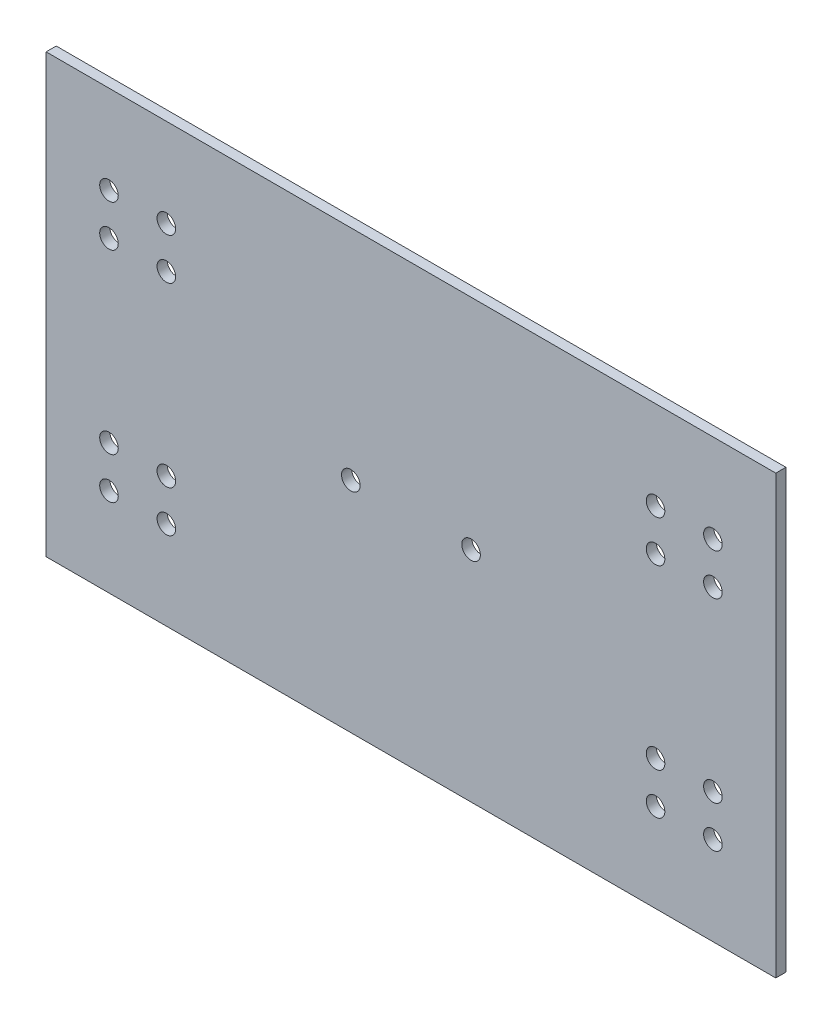
ISO-10303-21;
HEADER;
FILE_DESCRIPTION(('STEP AP214'),'2;1');
FILE_NAME('part.step','',(''),(''),'','','');
FILE_SCHEMA(('AUTOMOTIVE_DESIGN { 1 0 10303 214 1 1 1 1 }'));
ENDSEC;
DATA;
#1=APPLICATION_CONTEXT('core data for automotive mechanical design processes');
#2=APPLICATION_PROTOCOL_DEFINITION('international standard','automotive_design',2000,#1);
#3=PRODUCT_CONTEXT('',#1,'mechanical');
#4=PRODUCT('Part','Part','',(#3));
#5=PRODUCT_RELATED_PRODUCT_CATEGORY('part','',(#4));
#6=PRODUCT_DEFINITION_FORMATION('','',#4);
#7=PRODUCT_DEFINITION_CONTEXT('part definition',#1,'design');
#8=PRODUCT_DEFINITION('design','',#6,#7);
#9=PRODUCT_DEFINITION_SHAPE('','',#8);
#10=(LENGTH_UNIT() NAMED_UNIT(*) SI_UNIT(.MILLI.,.METRE.));
#11=(NAMED_UNIT(*) PLANE_ANGLE_UNIT() SI_UNIT($,.RADIAN.));
#12=(NAMED_UNIT(*) SI_UNIT($,.STERADIAN.) SOLID_ANGLE_UNIT());
#13=UNCERTAINTY_MEASURE_WITH_UNIT(LENGTH_MEASURE(1.E-05),#10,'distance_accuracy_value','');
#14=(GEOMETRIC_REPRESENTATION_CONTEXT(3) GLOBAL_UNCERTAINTY_ASSIGNED_CONTEXT((#13)) GLOBAL_UNIT_ASSIGNED_CONTEXT((#10,
#11,#12)) REPRESENTATION_CONTEXT('',''));
#15=CARTESIAN_POINT('',(0.,0.,0.));
#16=DIRECTION('',(0.,0.,1.));
#17=DIRECTION('',(1.,0.,0.));
#18=AXIS2_PLACEMENT_3D('',#15,#16,#17);
#19=CARTESIAN_POINT('',(155.5,80.0000000000001,3.7));
#20=DIRECTION('',(0.,0.,-1.));
#21=DIRECTION('',(-1.,0.,0.));
#22=AXIS2_PLACEMENT_3D('',#19,#20,#21);
#23=CYLINDRICAL_SURFACE('',#22,3.4);
#24=CARTESIAN_POINT('',(155.5,80.0000000000001,3.7));
#25=DIRECTION('',(0.,0.,1.));
#26=DIRECTION('',(1.,0.,0.));
#27=AXIS2_PLACEMENT_3D('',#24,#25,#26);
#28=CIRCLE('',#27,3.4);
#29=CARTESIAN_POINT('',(158.9,80.0000000000001,3.7));
#30=VERTEX_POINT('',#29);
#31=EDGE_CURVE('E205',#30,#30,#28,.F.);
#32=ORIENTED_EDGE('',*,*,#31,.F.);
#33=EDGE_LOOP('',(#32));
#34=FACE_BOUND('',#33,.T.);
#35=CARTESIAN_POINT('',(155.5,80.0000000000001,0.));
#36=DIRECTION('',(0.,0.,1.));
#37=DIRECTION('',(1.,0.,0.));
#38=AXIS2_PLACEMENT_3D('',#35,#36,#37);
#39=CIRCLE('',#38,3.4);
#40=CARTESIAN_POINT('',(158.9,80.0000000000001,0.));
#41=VERTEX_POINT('',#40);
#42=EDGE_CURVE('E303',#41,#41,#39,.F.);
#43=ORIENTED_EDGE('',*,*,#42,.T.);
#44=EDGE_LOOP('',(#43));
#45=FACE_BOUND('',#44,.T.);
#46=ADVANCED_FACE('F128',(#34,#45),#23,.F.);
#47=CARTESIAN_POINT('',(44.,127.6,3.7));
#48=DIRECTION('',(0.,0.,-1.));
#49=DIRECTION('',(-1.,0.,0.));
#50=AXIS2_PLACEMENT_3D('',#47,#48,#49);
#51=CYLINDRICAL_SURFACE('',#50,3.4);
#52=CARTESIAN_POINT('',(44.,127.6,3.7));
#53=DIRECTION('',(0.,0.,1.));
#54=DIRECTION('',(1.,0.,0.));
#55=AXIS2_PLACEMENT_3D('',#52,#53,#54);
#56=CIRCLE('',#55,3.4);
#57=CARTESIAN_POINT('',(47.4,127.6,3.7));
#58=VERTEX_POINT('',#57);
#59=EDGE_CURVE('E202',#58,#58,#56,.F.);
#60=ORIENTED_EDGE('',*,*,#59,.F.);
#61=EDGE_LOOP('',(#60));
#62=FACE_BOUND('',#61,.T.);
#63=CARTESIAN_POINT('',(44.,127.6,0.));
#64=DIRECTION('',(0.,0.,1.));
#65=DIRECTION('',(1.,0.,0.));
#66=AXIS2_PLACEMENT_3D('',#63,#64,#65);
#67=CIRCLE('',#66,3.4);
#68=CARTESIAN_POINT('',(47.4,127.6,0.));
#69=VERTEX_POINT('',#68);
#70=EDGE_CURVE('E299',#69,#69,#67,.F.);
#71=ORIENTED_EDGE('',*,*,#70,.T.);
#72=EDGE_LOOP('',(#71));
#73=FACE_BOUND('',#72,.T.);
#74=ADVANCED_FACE('F366',(#62,#73),#51,.F.);
#75=CARTESIAN_POINT('',(23.,112.4,3.7));
#76=DIRECTION('',(0.,0.,-1.));
#77=DIRECTION('',(-1.,0.,0.));
#78=AXIS2_PLACEMENT_3D('',#75,#76,#77);
#79=CYLINDRICAL_SURFACE('',#78,3.4);
#80=CARTESIAN_POINT('',(23.,112.4,3.7));
#81=DIRECTION('',(0.,0.,1.));
#82=DIRECTION('',(1.,0.,0.));
#83=AXIS2_PLACEMENT_3D('',#80,#81,#82);
#84=CIRCLE('',#83,3.4);
#85=CARTESIAN_POINT('',(26.4,112.4,3.7));
#86=VERTEX_POINT('',#85);
#87=EDGE_CURVE('E199',#86,#86,#84,.F.);
#88=ORIENTED_EDGE('',*,*,#87,.F.);
#89=EDGE_LOOP('',(#88));
#90=FACE_BOUND('',#89,.T.);
#91=CARTESIAN_POINT('',(23.,112.4,0.));
#92=DIRECTION('',(0.,0.,1.));
#93=DIRECTION('',(1.,0.,0.));
#94=AXIS2_PLACEMENT_3D('',#91,#92,#93);
#95=CIRCLE('',#94,3.4);
#96=CARTESIAN_POINT('',(26.4,112.4,0.));
#97=VERTEX_POINT('',#96);
#98=EDGE_CURVE('E295',#97,#97,#95,.F.);
#99=ORIENTED_EDGE('',*,*,#98,.T.);
#100=EDGE_LOOP('',(#99));
#101=FACE_BOUND('',#100,.T.);
#102=ADVANCED_FACE('F372',(#90,#101),#79,.F.);
#103=CARTESIAN_POINT('',(244.,32.4,3.7));
#104=DIRECTION('',(0.,0.,-1.));
#105=DIRECTION('',(-1.,0.,0.));
#106=AXIS2_PLACEMENT_3D('',#103,#104,#105);
#107=CYLINDRICAL_SURFACE('',#106,3.4);
#108=CARTESIAN_POINT('',(244.,32.4,3.7));
#109=DIRECTION('',(0.,0.,1.));
#110=DIRECTION('',(1.,0.,0.));
#111=AXIS2_PLACEMENT_3D('',#108,#109,#110);
#112=CIRCLE('',#111,3.4);
#113=CARTESIAN_POINT('',(247.4,32.4,3.7));
#114=VERTEX_POINT('',#113);
#115=EDGE_CURVE('E196',#114,#114,#112,.F.);
#116=ORIENTED_EDGE('',*,*,#115,.F.);
#117=EDGE_LOOP('',(#116));
#118=FACE_BOUND('',#117,.T.);
#119=CARTESIAN_POINT('',(244.,32.4,0.));
#120=DIRECTION('',(0.,0.,1.));
#121=DIRECTION('',(1.,0.,0.));
#122=AXIS2_PLACEMENT_3D('',#119,#120,#121);
#123=CIRCLE('',#122,3.4);
#124=CARTESIAN_POINT('',(247.4,32.4,0.));
#125=VERTEX_POINT('',#124);
#126=EDGE_CURVE('E291',#125,#125,#123,.F.);
#127=ORIENTED_EDGE('',*,*,#126,.T.);
#128=EDGE_LOOP('',(#127));
#129=FACE_BOUND('',#128,.T.);
#130=ADVANCED_FACE('F379',(#118,#129),#107,.F.);
#131=CARTESIAN_POINT('',(223.,47.6,3.7));
#132=DIRECTION('',(0.,0.,-1.));
#133=DIRECTION('',(-1.,0.,0.));
#134=AXIS2_PLACEMENT_3D('',#131,#132,#133);
#135=CYLINDRICAL_SURFACE('',#134,3.4);
#136=CARTESIAN_POINT('',(223.,47.6,3.7));
#137=DIRECTION('',(0.,0.,1.));
#138=DIRECTION('',(1.,0.,0.));
#139=AXIS2_PLACEMENT_3D('',#136,#137,#138);
#140=CIRCLE('',#139,3.4);
#141=CARTESIAN_POINT('',(226.4,47.6,3.7));
#142=VERTEX_POINT('',#141);
#143=EDGE_CURVE('E190',#142,#142,#140,.F.);
#144=ORIENTED_EDGE('',*,*,#143,.F.);
#145=EDGE_LOOP('',(#144));
#146=FACE_BOUND('',#145,.T.);
#147=CARTESIAN_POINT('',(223.,47.6,0.));
#148=DIRECTION('',(0.,0.,1.));
#149=DIRECTION('',(1.,0.,0.));
#150=AXIS2_PLACEMENT_3D('',#147,#148,#149);
#151=CIRCLE('',#150,3.4);
#152=CARTESIAN_POINT('',(226.4,47.6,0.));
#153=VERTEX_POINT('',#152);
#154=EDGE_CURVE('E285',#153,#153,#151,.F.);
#155=ORIENTED_EDGE('',*,*,#154,.T.);
#156=EDGE_LOOP('',(#155));
#157=FACE_BOUND('',#156,.T.);
#158=ADVANCED_FACE('F383',(#146,#157),#135,.F.);
#159=CARTESIAN_POINT('',(0.,0.,3.7));
#160=DIRECTION('',(1.,0.,0.));
#161=DIRECTION('',(0.,1.,0.));
#162=AXIS2_PLACEMENT_3D('',#159,#160,#161);
#163=PLANE('',#162);
#164=DIRECTION('',(0.,-1.,0.));
#165=VECTOR('',#164,1.);
#166=CARTESIAN_POINT('',(0.,0.,0.));
#167=LINE('',#166,#165);
#168=CARTESIAN_POINT('',(0.,160.,0.));
#169=VERTEX_POINT('',#168);
#170=CARTESIAN_POINT('',(0.,0.,0.));
#171=VERTEX_POINT('',#170);
#172=EDGE_CURVE('E184',#169,#171,#167,.T.);
#173=ORIENTED_EDGE('',*,*,#172,.T.);
#174=DIRECTION('',(0.,0.,-1.));
#175=VECTOR('',#174,1.);
#176=CARTESIAN_POINT('',(0.,0.,3.7));
#177=LINE('',#176,#175);
#178=CARTESIAN_POINT('',(0.,0.,3.7));
#179=VERTEX_POINT('',#178);
#180=EDGE_CURVE('E137',#179,#171,#177,.T.);
#181=ORIENTED_EDGE('',*,*,#180,.F.);
#182=DIRECTION('',(0.,-1.,0.));
#183=VECTOR('',#182,1.);
#184=CARTESIAN_POINT('',(0.,0.,3.7));
#185=LINE('',#184,#183);
#186=CARTESIAN_POINT('',(0.,160.,3.7));
#187=VERTEX_POINT('',#186);
#188=EDGE_CURVE('E170',#187,#179,#185,.T.);
#189=ORIENTED_EDGE('',*,*,#188,.F.);
#190=DIRECTION('',(0.,0.,-1.));
#191=VECTOR('',#190,1.);
#192=CARTESIAN_POINT('',(0.,160.,3.7));
#193=LINE('',#192,#191);
#194=EDGE_CURVE('E13',#187,#169,#193,.T.);
#195=ORIENTED_EDGE('',*,*,#194,.T.);
#196=EDGE_LOOP('',(#173,#181,#189,#195));
#197=FACE_BOUND('',#196,.T.);
#198=ADVANCED_FACE('F183',(#197),#163,.F.);
#199=CARTESIAN_POINT('',(0.,0.,3.7));
#200=DIRECTION('',(0.,-1.,0.));
#201=DIRECTION('',(1.,0.,0.));
#202=AXIS2_PLACEMENT_3D('',#199,#200,#201);
#203=PLANE('',#202);
#204=DIRECTION('',(-1.,0.,0.));
#205=VECTOR('',#204,1.);
#206=CARTESIAN_POINT('',(0.,0.,0.));
#207=LINE('',#206,#205);
#208=CARTESIAN_POINT('',(267.,0.,0.));
#209=VERTEX_POINT('',#208);
#210=EDGE_CURVE('E286',#209,#171,#207,.T.);
#211=ORIENTED_EDGE('',*,*,#210,.F.);
#212=DIRECTION('',(0.,0.,-1.));
#213=VECTOR('',#212,1.);
#214=CARTESIAN_POINT('',(267.,0.,3.7));
#215=LINE('',#214,#213);
#216=CARTESIAN_POINT('',(267.,0.,3.7));
#217=VERTEX_POINT('',#216);
#218=EDGE_CURVE('E159',#217,#209,#215,.T.);
#219=ORIENTED_EDGE('',*,*,#218,.F.);
#220=DIRECTION('',(-1.,0.,0.));
#221=VECTOR('',#220,1.);
#222=CARTESIAN_POINT('',(0.,0.,3.7));
#223=LINE('',#222,#221);
#224=EDGE_CURVE('E178',#217,#179,#223,.T.);
#225=ORIENTED_EDGE('',*,*,#224,.T.);
#226=ORIENTED_EDGE('',*,*,#180,.T.);
#227=EDGE_LOOP('',(#211,#219,#225,#226));
#228=FACE_BOUND('',#227,.T.);
#229=ADVANCED_FACE('F187',(#228),#203,.T.);
#230=CARTESIAN_POINT('',(267.,0.,3.7));
#231=DIRECTION('',(1.,0.,0.));
#232=DIRECTION('',(0.,0.,-1.));
#233=AXIS2_PLACEMENT_3D('',#230,#231,#232);
#234=PLANE('',#233);
#235=DIRECTION('',(0.,-1.,0.));
#236=VECTOR('',#235,1.);
#237=CARTESIAN_POINT('',(267.,0.,0.));
#238=LINE('',#237,#236);
#239=CARTESIAN_POINT('',(267.,160.,0.));
#240=VERTEX_POINT('',#239);
#241=EDGE_CURVE('E280',#240,#209,#238,.T.);
#242=ORIENTED_EDGE('',*,*,#241,.F.);
#243=DIRECTION('',(0.,0.,-1.));
#244=VECTOR('',#243,1.);
#245=CARTESIAN_POINT('',(267.,160.,3.7));
#246=LINE('',#245,#244);
#247=CARTESIAN_POINT('',(267.,160.,3.7));
#248=VERTEX_POINT('',#247);
#249=EDGE_CURVE('E145',#248,#240,#246,.T.);
#250=ORIENTED_EDGE('',*,*,#249,.F.);
#251=DIRECTION('',(0.,-1.,0.));
#252=VECTOR('',#251,1.);
#253=CARTESIAN_POINT('',(267.,0.,3.7));
#254=LINE('',#253,#252);
#255=EDGE_CURVE('E188',#248,#217,#254,.T.);
#256=ORIENTED_EDGE('',*,*,#255,.T.);
#257=ORIENTED_EDGE('',*,*,#218,.T.);
#258=EDGE_LOOP('',(#242,#250,#256,#257));
#259=FACE_BOUND('',#258,.T.);
#260=ADVANCED_FACE('F388',(#259),#234,.T.);
#261=CARTESIAN_POINT('',(0.,160.,3.7));
#262=DIRECTION('',(0.,-1.,0.));
#263=DIRECTION('',(1.,0.,0.));
#264=AXIS2_PLACEMENT_3D('',#261,#262,#263);
#265=PLANE('',#264);
#266=DIRECTION('',(-1.,0.,0.));
#267=VECTOR('',#266,1.);
#268=CARTESIAN_POINT('',(0.,160.,0.));
#269=LINE('',#268,#267);
#270=EDGE_CURVE('E273',#240,#169,#269,.T.);
#271=ORIENTED_EDGE('',*,*,#270,.T.);
#272=ORIENTED_EDGE('',*,*,#194,.F.);
#273=DIRECTION('',(-1.,0.,0.));
#274=VECTOR('',#273,1.);
#275=CARTESIAN_POINT('',(0.,160.,3.7));
#276=LINE('',#275,#274);
#277=EDGE_CURVE('E179',#248,#187,#276,.T.);
#278=ORIENTED_EDGE('',*,*,#277,.F.);
#279=ORIENTED_EDGE('',*,*,#249,.T.);
#280=EDGE_LOOP('',(#271,#272,#278,#279));
#281=FACE_BOUND('',#280,.T.);
#282=ADVANCED_FACE('F391',(#281),#265,.F.);
#283=CARTESIAN_POINT('',(23.,47.6,3.7));
#284=DIRECTION('',(0.,0.,-1.));
#285=DIRECTION('',(-1.,0.,0.));
#286=AXIS2_PLACEMENT_3D('',#283,#284,#285);
#287=CYLINDRICAL_SURFACE('',#286,3.4);
#288=CARTESIAN_POINT('',(23.,47.6,3.7));
#289=DIRECTION('',(0.,0.,1.));
#290=DIRECTION('',(1.,0.,0.));
#291=AXIS2_PLACEMENT_3D('',#288,#289,#290);
#292=CIRCLE('',#291,3.4);
#293=CARTESIAN_POINT('',(26.4,47.6,3.7));
#294=VERTEX_POINT('',#293);
#295=EDGE_CURVE('E349',#294,#294,#292,.T.);
#296=ORIENTED_EDGE('',*,*,#295,.T.);
#297=EDGE_LOOP('',(#296));
#298=FACE_BOUND('',#297,.T.);
#299=CARTESIAN_POINT('',(23.,47.6,0.));
#300=DIRECTION('',(0.,0.,1.));
#301=DIRECTION('',(1.,0.,0.));
#302=AXIS2_PLACEMENT_3D('',#299,#300,#301);
#303=CIRCLE('',#302,3.4);
#304=CARTESIAN_POINT('',(26.4,47.6,0.));
#305=VERTEX_POINT('',#304);
#306=EDGE_CURVE('E268',#305,#305,#303,.T.);
#307=ORIENTED_EDGE('',*,*,#306,.F.);
#308=EDGE_LOOP('',(#307));
#309=FACE_BOUND('',#308,.T.);
#310=ADVANCED_FACE('F353',(#298,#309),#287,.F.);
#311=CARTESIAN_POINT('',(44.,47.6,3.7));
#312=DIRECTION('',(0.,0.,-1.));
#313=DIRECTION('',(-1.,0.,0.));
#314=AXIS2_PLACEMENT_3D('',#311,#312,#313);
#315=CYLINDRICAL_SURFACE('',#314,3.4);
#316=CARTESIAN_POINT('',(44.,47.6,3.7));
#317=DIRECTION('',(0.,0.,1.));
#318=DIRECTION('',(1.,0.,0.));
#319=AXIS2_PLACEMENT_3D('',#316,#317,#318);
#320=CIRCLE('',#319,3.4);
#321=CARTESIAN_POINT('',(47.4,47.6,3.7));
#322=VERTEX_POINT('',#321);
#323=EDGE_CURVE('E346',#322,#322,#320,.T.);
#324=ORIENTED_EDGE('',*,*,#323,.T.);
#325=EDGE_LOOP('',(#324));
#326=FACE_BOUND('',#325,.T.);
#327=CARTESIAN_POINT('',(44.,47.6,0.));
#328=DIRECTION('',(0.,0.,1.));
#329=DIRECTION('',(1.,0.,0.));
#330=AXIS2_PLACEMENT_3D('',#327,#328,#329);
#331=CIRCLE('',#330,3.4);
#332=CARTESIAN_POINT('',(47.4,47.6,0.));
#333=VERTEX_POINT('',#332);
#334=EDGE_CURVE('E264',#333,#333,#331,.T.);
#335=ORIENTED_EDGE('',*,*,#334,.F.);
#336=EDGE_LOOP('',(#335));
#337=FACE_BOUND('',#336,.T.);
#338=ADVANCED_FACE('F400',(#326,#337),#315,.F.);
#339=CARTESIAN_POINT('',(23.,32.4,3.7));
#340=DIRECTION('',(0.,0.,-1.));
#341=DIRECTION('',(-1.,0.,0.));
#342=AXIS2_PLACEMENT_3D('',#339,#340,#341);
#343=CYLINDRICAL_SURFACE('',#342,3.4);
#344=CARTESIAN_POINT('',(23.,32.4,3.7));
#345=DIRECTION('',(0.,0.,1.));
#346=DIRECTION('',(1.,0.,0.));
#347=AXIS2_PLACEMENT_3D('',#344,#345,#346);
#348=CIRCLE('',#347,3.4);
#349=CARTESIAN_POINT('',(26.4,32.4,3.7));
#350=VERTEX_POINT('',#349);
#351=EDGE_CURVE('E343',#350,#350,#348,.T.);
#352=ORIENTED_EDGE('',*,*,#351,.T.);
#353=EDGE_LOOP('',(#352));
#354=FACE_BOUND('',#353,.T.);
#355=CARTESIAN_POINT('',(23.,32.4,0.));
#356=DIRECTION('',(0.,0.,1.));
#357=DIRECTION('',(1.,0.,0.));
#358=AXIS2_PLACEMENT_3D('',#355,#356,#357);
#359=CIRCLE('',#358,3.4);
#360=CARTESIAN_POINT('',(26.4,32.4,0.));
#361=VERTEX_POINT('',#360);
#362=EDGE_CURVE('E256',#361,#361,#359,.T.);
#363=ORIENTED_EDGE('',*,*,#362,.F.);
#364=EDGE_LOOP('',(#363));
#365=FACE_BOUND('',#364,.T.);
#366=ADVANCED_FACE('F403',(#354,#365),#343,.F.);
#367=CARTESIAN_POINT('',(44.,32.4,3.7));
#368=DIRECTION('',(0.,0.,-1.));
#369=DIRECTION('',(-1.,0.,0.));
#370=AXIS2_PLACEMENT_3D('',#367,#368,#369);
#371=CYLINDRICAL_SURFACE('',#370,3.4);
#372=CARTESIAN_POINT('',(44.,32.4,3.7));
#373=DIRECTION('',(0.,0.,1.));
#374=DIRECTION('',(1.,0.,0.));
#375=AXIS2_PLACEMENT_3D('',#372,#373,#374);
#376=CIRCLE('',#375,3.4);
#377=CARTESIAN_POINT('',(47.4,32.4,3.7));
#378=VERTEX_POINT('',#377);
#379=EDGE_CURVE('E340',#378,#378,#376,.T.);
#380=ORIENTED_EDGE('',*,*,#379,.T.);
#381=EDGE_LOOP('',(#380));
#382=FACE_BOUND('',#381,.T.);
#383=CARTESIAN_POINT('',(44.,32.4,0.));
#384=DIRECTION('',(0.,0.,1.));
#385=DIRECTION('',(1.,0.,0.));
#386=AXIS2_PLACEMENT_3D('',#383,#384,#385);
#387=CIRCLE('',#386,3.4);
#388=CARTESIAN_POINT('',(47.4,32.4,0.));
#389=VERTEX_POINT('',#388);
#390=EDGE_CURVE('E251',#389,#389,#387,.T.);
#391=ORIENTED_EDGE('',*,*,#390,.F.);
#392=EDGE_LOOP('',(#391));
#393=FACE_BOUND('',#392,.T.);
#394=ADVANCED_FACE('F407',(#382,#393),#371,.F.);
#395=CARTESIAN_POINT('',(223.,32.4,3.7));
#396=DIRECTION('',(0.,0.,-1.));
#397=DIRECTION('',(-1.,0.,0.));
#398=AXIS2_PLACEMENT_3D('',#395,#396,#397);
#399=CYLINDRICAL_SURFACE('',#398,3.4);
#400=CARTESIAN_POINT('',(223.,32.4,3.7));
#401=DIRECTION('',(0.,0.,1.));
#402=DIRECTION('',(1.,0.,0.));
#403=AXIS2_PLACEMENT_3D('',#400,#401,#402);
#404=CIRCLE('',#403,3.4);
#405=CARTESIAN_POINT('',(226.4,32.4,3.7));
#406=VERTEX_POINT('',#405);
#407=EDGE_CURVE('E337',#406,#406,#404,.F.);
#408=ORIENTED_EDGE('',*,*,#407,.F.);
#409=EDGE_LOOP('',(#408));
#410=FACE_BOUND('',#409,.T.);
#411=CARTESIAN_POINT('',(223.,32.4,0.));
#412=DIRECTION('',(0.,0.,1.));
#413=DIRECTION('',(1.,0.,0.));
#414=AXIS2_PLACEMENT_3D('',#411,#412,#413);
#415=CIRCLE('',#414,3.4);
#416=CARTESIAN_POINT('',(226.4,32.4,0.));
#417=VERTEX_POINT('',#416);
#418=EDGE_CURVE('E247',#417,#417,#415,.F.);
#419=ORIENTED_EDGE('',*,*,#418,.T.);
#420=EDGE_LOOP('',(#419));
#421=FACE_BOUND('',#420,.T.);
#422=ADVANCED_FACE('F411',(#410,#421),#399,.F.);
#423=CARTESIAN_POINT('',(244.,47.6,3.7));
#424=DIRECTION('',(0.,0.,-1.));
#425=DIRECTION('',(-1.,0.,0.));
#426=AXIS2_PLACEMENT_3D('',#423,#424,#425);
#427=CYLINDRICAL_SURFACE('',#426,3.4);
#428=CARTESIAN_POINT('',(244.,47.6,3.7));
#429=DIRECTION('',(0.,0.,1.));
#430=DIRECTION('',(1.,0.,0.));
#431=AXIS2_PLACEMENT_3D('',#428,#429,#430);
#432=CIRCLE('',#431,3.4);
#433=CARTESIAN_POINT('',(247.4,47.6,3.7));
#434=VERTEX_POINT('',#433);
#435=EDGE_CURVE('E334',#434,#434,#432,.F.);
#436=ORIENTED_EDGE('',*,*,#435,.F.);
#437=EDGE_LOOP('',(#436));
#438=FACE_BOUND('',#437,.T.);
#439=CARTESIAN_POINT('',(244.,47.6,0.));
#440=DIRECTION('',(0.,0.,1.));
#441=DIRECTION('',(1.,0.,0.));
#442=AXIS2_PLACEMENT_3D('',#439,#440,#441);
#443=CIRCLE('',#442,3.4);
#444=CARTESIAN_POINT('',(247.4,47.6,0.));
#445=VERTEX_POINT('',#444);
#446=EDGE_CURVE('E243',#445,#445,#443,.F.);
#447=ORIENTED_EDGE('',*,*,#446,.T.);
#448=EDGE_LOOP('',(#447));
#449=FACE_BOUND('',#448,.T.);
#450=ADVANCED_FACE('F415',(#438,#449),#427,.F.);
#451=CARTESIAN_POINT('',(23.,127.6,3.7));
#452=DIRECTION('',(0.,0.,-1.));
#453=DIRECTION('',(-1.,0.,0.));
#454=AXIS2_PLACEMENT_3D('',#451,#452,#453);
#455=CYLINDRICAL_SURFACE('',#454,3.4);
#456=CARTESIAN_POINT('',(23.,127.6,3.7));
#457=DIRECTION('',(0.,0.,1.));
#458=DIRECTION('',(1.,0.,0.));
#459=AXIS2_PLACEMENT_3D('',#456,#457,#458);
#460=CIRCLE('',#459,3.4);
#461=CARTESIAN_POINT('',(26.4,127.6,3.7));
#462=VERTEX_POINT('',#461);
#463=EDGE_CURVE('E331',#462,#462,#460,.F.);
#464=ORIENTED_EDGE('',*,*,#463,.F.);
#465=EDGE_LOOP('',(#464));
#466=FACE_BOUND('',#465,.T.);
#467=CARTESIAN_POINT('',(23.,127.6,0.));
#468=DIRECTION('',(0.,0.,1.));
#469=DIRECTION('',(1.,0.,0.));
#470=AXIS2_PLACEMENT_3D('',#467,#468,#469);
#471=CIRCLE('',#470,3.4);
#472=CARTESIAN_POINT('',(26.4,127.6,0.));
#473=VERTEX_POINT('',#472);
#474=EDGE_CURVE('E239',#473,#473,#471,.F.);
#475=ORIENTED_EDGE('',*,*,#474,.T.);
#476=EDGE_LOOP('',(#475));
#477=FACE_BOUND('',#476,.T.);
#478=ADVANCED_FACE('F419',(#466,#477),#455,.F.);
#479=CARTESIAN_POINT('',(44.,112.4,3.7));
#480=DIRECTION('',(0.,0.,-1.));
#481=DIRECTION('',(-1.,0.,0.));
#482=AXIS2_PLACEMENT_3D('',#479,#480,#481);
#483=CYLINDRICAL_SURFACE('',#482,3.4);
#484=CARTESIAN_POINT('',(44.,112.4,3.7));
#485=DIRECTION('',(0.,0.,1.));
#486=DIRECTION('',(1.,0.,0.));
#487=AXIS2_PLACEMENT_3D('',#484,#485,#486);
#488=CIRCLE('',#487,3.4);
#489=CARTESIAN_POINT('',(47.4,112.4,3.7));
#490=VERTEX_POINT('',#489);
#491=EDGE_CURVE('E328',#490,#490,#488,.F.);
#492=ORIENTED_EDGE('',*,*,#491,.F.);
#493=EDGE_LOOP('',(#492));
#494=FACE_BOUND('',#493,.T.);
#495=CARTESIAN_POINT('',(44.,112.4,0.));
#496=DIRECTION('',(0.,0.,1.));
#497=DIRECTION('',(1.,0.,0.));
#498=AXIS2_PLACEMENT_3D('',#495,#496,#497);
#499=CIRCLE('',#498,3.4);
#500=CARTESIAN_POINT('',(47.4,112.4,0.));
#501=VERTEX_POINT('',#500);
#502=EDGE_CURVE('E235',#501,#501,#499,.F.);
#503=ORIENTED_EDGE('',*,*,#502,.T.);
#504=EDGE_LOOP('',(#503));
#505=FACE_BOUND('',#504,.T.);
#506=ADVANCED_FACE('F423',(#494,#505),#483,.F.);
#507=CARTESIAN_POINT('',(223.,112.4,3.7));
#508=DIRECTION('',(0.,0.,-1.));
#509=DIRECTION('',(-1.,0.,0.));
#510=AXIS2_PLACEMENT_3D('',#507,#508,#509);
#511=CYLINDRICAL_SURFACE('',#510,3.4);
#512=CARTESIAN_POINT('',(223.,112.4,3.7));
#513=DIRECTION('',(0.,0.,1.));
#514=DIRECTION('',(1.,0.,0.));
#515=AXIS2_PLACEMENT_3D('',#512,#513,#514);
#516=CIRCLE('',#515,3.4);
#517=CARTESIAN_POINT('',(226.4,112.4,3.7));
#518=VERTEX_POINT('',#517);
#519=EDGE_CURVE('E325',#518,#518,#516,.T.);
#520=ORIENTED_EDGE('',*,*,#519,.T.);
#521=EDGE_LOOP('',(#520));
#522=FACE_BOUND('',#521,.T.);
#523=CARTESIAN_POINT('',(223.,112.4,0.));
#524=DIRECTION('',(0.,0.,1.));
#525=DIRECTION('',(1.,0.,0.));
#526=AXIS2_PLACEMENT_3D('',#523,#524,#525);
#527=CIRCLE('',#526,3.4);
#528=CARTESIAN_POINT('',(226.4,112.4,0.));
#529=VERTEX_POINT('',#528);
#530=EDGE_CURVE('E230',#529,#529,#527,.T.);
#531=ORIENTED_EDGE('',*,*,#530,.F.);
#532=EDGE_LOOP('',(#531));
#533=FACE_BOUND('',#532,.T.);
#534=ADVANCED_FACE('F427',(#522,#533),#511,.F.);
#535=CARTESIAN_POINT('',(223.,127.6,3.7));
#536=DIRECTION('',(0.,0.,-1.));
#537=DIRECTION('',(-1.,0.,0.));
#538=AXIS2_PLACEMENT_3D('',#535,#536,#537);
#539=CYLINDRICAL_SURFACE('',#538,3.39999999999999);
#540=CARTESIAN_POINT('',(223.,127.6,3.7));
#541=DIRECTION('',(0.,0.,1.));
#542=DIRECTION('',(1.,0.,0.));
#543=AXIS2_PLACEMENT_3D('',#540,#541,#542);
#544=CIRCLE('',#543,3.39999999999999);
#545=CARTESIAN_POINT('',(226.4,127.6,3.7));
#546=VERTEX_POINT('',#545);
#547=EDGE_CURVE('E322',#546,#546,#544,.T.);
#548=ORIENTED_EDGE('',*,*,#547,.T.);
#549=EDGE_LOOP('',(#548));
#550=FACE_BOUND('',#549,.T.);
#551=CARTESIAN_POINT('',(223.,127.6,0.));
#552=DIRECTION('',(0.,0.,1.));
#553=DIRECTION('',(1.,0.,0.));
#554=AXIS2_PLACEMENT_3D('',#551,#552,#553);
#555=CIRCLE('',#554,3.39999999999999);
#556=CARTESIAN_POINT('',(226.4,127.6,0.));
#557=VERTEX_POINT('',#556);
#558=EDGE_CURVE('E226',#557,#557,#555,.T.);
#559=ORIENTED_EDGE('',*,*,#558,.F.);
#560=EDGE_LOOP('',(#559));
#561=FACE_BOUND('',#560,.T.);
#562=ADVANCED_FACE('F431',(#550,#561),#539,.F.);
#563=CARTESIAN_POINT('',(244.,127.6,3.7));
#564=DIRECTION('',(0.,0.,-1.));
#565=DIRECTION('',(-1.,0.,0.));
#566=AXIS2_PLACEMENT_3D('',#563,#564,#565);
#567=CYLINDRICAL_SURFACE('',#566,3.39999999999999);
#568=CARTESIAN_POINT('',(244.,127.6,3.7));
#569=DIRECTION('',(0.,0.,1.));
#570=DIRECTION('',(1.,0.,0.));
#571=AXIS2_PLACEMENT_3D('',#568,#569,#570);
#572=CIRCLE('',#571,3.39999999999999);
#573=CARTESIAN_POINT('',(247.4,127.6,3.7));
#574=VERTEX_POINT('',#573);
#575=EDGE_CURVE('E317',#574,#574,#572,.T.);
#576=ORIENTED_EDGE('',*,*,#575,.T.);
#577=EDGE_LOOP('',(#576));
#578=FACE_BOUND('',#577,.T.);
#579=CARTESIAN_POINT('',(244.,127.6,0.));
#580=DIRECTION('',(0.,0.,1.));
#581=DIRECTION('',(1.,0.,0.));
#582=AXIS2_PLACEMENT_3D('',#579,#580,#581);
#583=CIRCLE('',#582,3.39999999999999);
#584=CARTESIAN_POINT('',(247.4,127.6,0.));
#585=VERTEX_POINT('',#584);
#586=EDGE_CURVE('E217',#585,#585,#583,.T.);
#587=ORIENTED_EDGE('',*,*,#586,.F.);
#588=EDGE_LOOP('',(#587));
#589=FACE_BOUND('',#588,.T.);
#590=ADVANCED_FACE('F435',(#578,#589),#567,.F.);
#591=CARTESIAN_POINT('',(244.,112.4,3.7));
#592=DIRECTION('',(0.,0.,-1.));
#593=DIRECTION('',(-1.,0.,0.));
#594=AXIS2_PLACEMENT_3D('',#591,#592,#593);
#595=CYLINDRICAL_SURFACE('',#594,3.4);
#596=CARTESIAN_POINT('',(244.,112.4,3.7));
#597=DIRECTION('',(0.,0.,1.));
#598=DIRECTION('',(1.,0.,0.));
#599=AXIS2_PLACEMENT_3D('',#596,#597,#598);
#600=CIRCLE('',#599,3.4);
#601=CARTESIAN_POINT('',(247.4,112.4,3.7));
#602=VERTEX_POINT('',#601);
#603=EDGE_CURVE('E312',#602,#602,#600,.T.);
#604=ORIENTED_EDGE('',*,*,#603,.T.);
#605=EDGE_LOOP('',(#604));
#606=FACE_BOUND('',#605,.T.);
#607=CARTESIAN_POINT('',(244.,112.4,0.));
#608=DIRECTION('',(0.,0.,1.));
#609=DIRECTION('',(1.,0.,0.));
#610=AXIS2_PLACEMENT_3D('',#607,#608,#609);
#611=CIRCLE('',#610,3.4);
#612=CARTESIAN_POINT('',(247.4,112.4,0.));
#613=VERTEX_POINT('',#612);
#614=EDGE_CURVE('E212',#613,#613,#611,.T.);
#615=ORIENTED_EDGE('',*,*,#614,.F.);
#616=EDGE_LOOP('',(#615));
#617=FACE_BOUND('',#616,.T.);
#618=ADVANCED_FACE('F438',(#606,#617),#595,.F.);
#619=CARTESIAN_POINT('',(111.5,80.,3.7));
#620=DIRECTION('',(0.,0.,-1.));
#621=DIRECTION('',(-1.,0.,0.));
#622=AXIS2_PLACEMENT_3D('',#619,#620,#621);
#623=CYLINDRICAL_SURFACE('',#622,3.4);
#624=CARTESIAN_POINT('',(111.5,80.,3.7));
#625=DIRECTION('',(0.,0.,1.));
#626=DIRECTION('',(1.,0.,0.));
#627=AXIS2_PLACEMENT_3D('',#624,#625,#626);
#628=CIRCLE('',#627,3.4);
#629=CARTESIAN_POINT('',(114.9,80.,3.7));
#630=VERTEX_POINT('',#629);
#631=EDGE_CURVE('E307',#630,#630,#628,.F.);
#632=ORIENTED_EDGE('',*,*,#631,.F.);
#633=EDGE_LOOP('',(#632));
#634=FACE_BOUND('',#633,.T.);
#635=CARTESIAN_POINT('',(111.5,80.,0.));
#636=DIRECTION('',(0.,0.,1.));
#637=DIRECTION('',(1.,0.,0.));
#638=AXIS2_PLACEMENT_3D('',#635,#636,#637);
#639=CIRCLE('',#638,3.4);
#640=CARTESIAN_POINT('',(114.9,80.,0.));
#641=VERTEX_POINT('',#640);
#642=EDGE_CURVE('E208',#641,#641,#639,.F.);
#643=ORIENTED_EDGE('',*,*,#642,.T.);
#644=EDGE_LOOP('',(#643));
#645=FACE_BOUND('',#644,.T.);
#646=ADVANCED_FACE('F130',(#634,#645),#623,.F.);
#647=CARTESIAN_POINT('',(0.,0.,0.));
#648=DIRECTION('',(0.,0.,1.));
#649=DIRECTION('',(1.,0.,0.));
#650=AXIS2_PLACEMENT_3D('',#647,#648,#649);
#651=PLANE('',#650);
#652=ORIENTED_EDGE('',*,*,#642,.F.);
#653=EDGE_LOOP('',(#652));
#654=FACE_BOUND('',#653,.T.);
#655=ORIENTED_EDGE('',*,*,#614,.T.);
#656=EDGE_LOOP('',(#655));
#657=FACE_BOUND('',#656,.T.);
#658=ORIENTED_EDGE('',*,*,#586,.T.);
#659=EDGE_LOOP('',(#658));
#660=FACE_BOUND('',#659,.T.);
#661=ORIENTED_EDGE('',*,*,#558,.T.);
#662=EDGE_LOOP('',(#661));
#663=FACE_BOUND('',#662,.T.);
#664=ORIENTED_EDGE('',*,*,#530,.T.);
#665=EDGE_LOOP('',(#664));
#666=FACE_BOUND('',#665,.T.);
#667=ORIENTED_EDGE('',*,*,#502,.F.);
#668=EDGE_LOOP('',(#667));
#669=FACE_BOUND('',#668,.T.);
#670=ORIENTED_EDGE('',*,*,#474,.F.);
#671=EDGE_LOOP('',(#670));
#672=FACE_BOUND('',#671,.T.);
#673=ORIENTED_EDGE('',*,*,#446,.F.);
#674=EDGE_LOOP('',(#673));
#675=FACE_BOUND('',#674,.T.);
#676=ORIENTED_EDGE('',*,*,#418,.F.);
#677=EDGE_LOOP('',(#676));
#678=FACE_BOUND('',#677,.T.);
#679=ORIENTED_EDGE('',*,*,#390,.T.);
#680=EDGE_LOOP('',(#679));
#681=FACE_BOUND('',#680,.T.);
#682=ORIENTED_EDGE('',*,*,#362,.T.);
#683=EDGE_LOOP('',(#682));
#684=FACE_BOUND('',#683,.T.);
#685=ORIENTED_EDGE('',*,*,#334,.T.);
#686=EDGE_LOOP('',(#685));
#687=FACE_BOUND('',#686,.T.);
#688=ORIENTED_EDGE('',*,*,#306,.T.);
#689=EDGE_LOOP('',(#688));
#690=FACE_BOUND('',#689,.T.);
#691=ORIENTED_EDGE('',*,*,#270,.F.);
#692=ORIENTED_EDGE('',*,*,#241,.T.);
#693=ORIENTED_EDGE('',*,*,#210,.T.);
#694=ORIENTED_EDGE('',*,*,#172,.F.);
#695=EDGE_LOOP('',(#691,#692,#693,#694));
#696=FACE_BOUND('',#695,.T.);
#697=ORIENTED_EDGE('',*,*,#154,.F.);
#698=EDGE_LOOP('',(#697));
#699=FACE_BOUND('',#698,.T.);
#700=ORIENTED_EDGE('',*,*,#126,.F.);
#701=EDGE_LOOP('',(#700));
#702=FACE_BOUND('',#701,.T.);
#703=ORIENTED_EDGE('',*,*,#98,.F.);
#704=EDGE_LOOP('',(#703));
#705=FACE_BOUND('',#704,.T.);
#706=ORIENTED_EDGE('',*,*,#70,.F.);
#707=EDGE_LOOP('',(#706));
#708=FACE_BOUND('',#707,.T.);
#709=ORIENTED_EDGE('',*,*,#42,.F.);
#710=EDGE_LOOP('',(#709));
#711=FACE_BOUND('',#710,.T.);
#712=ADVANCED_FACE('F357',(#654,#657,#660,#663,#666,#669,#672,#675,#678,#681,#684,#687,#690,
#696,#699,#702,#705,#708,#711),#651,.F.);
#713=CARTESIAN_POINT('',(0.,0.,3.7));
#714=DIRECTION('',(0.,0.,1.));
#715=DIRECTION('',(1.,0.,0.));
#716=AXIS2_PLACEMENT_3D('',#713,#714,#715);
#717=PLANE('',#716);
#718=ORIENTED_EDGE('',*,*,#631,.T.);
#719=EDGE_LOOP('',(#718));
#720=FACE_BOUND('',#719,.T.);
#721=ORIENTED_EDGE('',*,*,#603,.F.);
#722=EDGE_LOOP('',(#721));
#723=FACE_BOUND('',#722,.T.);
#724=ORIENTED_EDGE('',*,*,#575,.F.);
#725=EDGE_LOOP('',(#724));
#726=FACE_BOUND('',#725,.T.);
#727=ORIENTED_EDGE('',*,*,#547,.F.);
#728=EDGE_LOOP('',(#727));
#729=FACE_BOUND('',#728,.T.);
#730=ORIENTED_EDGE('',*,*,#519,.F.);
#731=EDGE_LOOP('',(#730));
#732=FACE_BOUND('',#731,.T.);
#733=ORIENTED_EDGE('',*,*,#491,.T.);
#734=EDGE_LOOP('',(#733));
#735=FACE_BOUND('',#734,.T.);
#736=ORIENTED_EDGE('',*,*,#463,.T.);
#737=EDGE_LOOP('',(#736));
#738=FACE_BOUND('',#737,.T.);
#739=ORIENTED_EDGE('',*,*,#435,.T.);
#740=EDGE_LOOP('',(#739));
#741=FACE_BOUND('',#740,.T.);
#742=ORIENTED_EDGE('',*,*,#407,.T.);
#743=EDGE_LOOP('',(#742));
#744=FACE_BOUND('',#743,.T.);
#745=ORIENTED_EDGE('',*,*,#379,.F.);
#746=EDGE_LOOP('',(#745));
#747=FACE_BOUND('',#746,.T.);
#748=ORIENTED_EDGE('',*,*,#351,.F.);
#749=EDGE_LOOP('',(#748));
#750=FACE_BOUND('',#749,.T.);
#751=ORIENTED_EDGE('',*,*,#323,.F.);
#752=EDGE_LOOP('',(#751));
#753=FACE_BOUND('',#752,.T.);
#754=ORIENTED_EDGE('',*,*,#295,.F.);
#755=EDGE_LOOP('',(#754));
#756=FACE_BOUND('',#755,.T.);
#757=ORIENTED_EDGE('',*,*,#277,.T.);
#758=ORIENTED_EDGE('',*,*,#188,.T.);
#759=ORIENTED_EDGE('',*,*,#224,.F.);
#760=ORIENTED_EDGE('',*,*,#255,.F.);
#761=EDGE_LOOP('',(#757,#758,#759,#760));
#762=FACE_BOUND('',#761,.T.);
#763=ORIENTED_EDGE('',*,*,#143,.T.);
#764=EDGE_LOOP('',(#763));
#765=FACE_BOUND('',#764,.T.);
#766=ORIENTED_EDGE('',*,*,#115,.T.);
#767=EDGE_LOOP('',(#766));
#768=FACE_BOUND('',#767,.T.);
#769=ORIENTED_EDGE('',*,*,#87,.T.);
#770=EDGE_LOOP('',(#769));
#771=FACE_BOUND('',#770,.T.);
#772=ORIENTED_EDGE('',*,*,#59,.T.);
#773=EDGE_LOOP('',(#772));
#774=FACE_BOUND('',#773,.T.);
#775=ORIENTED_EDGE('',*,*,#31,.T.);
#776=EDGE_LOOP('',(#775));
#777=FACE_BOUND('',#776,.T.);
#778=ADVANCED_FACE('F174',(#720,#723,#726,#729,#732,#735,#738,#741,#744,#747,#750,#753,#756,
#762,#765,#768,#771,#774,#777),#717,.T.);
#779=CLOSED_SHELL('',(#46,#74,#102,#130,#158,#198,#229,#260,#282,#310,#338,#366,#394,#422,#450,
#478,#506,#534,#562,#590,#618,#646,#712,#778));
#780=MANIFOLD_SOLID_BREP('B2',#779);
#781=ADVANCED_BREP_SHAPE_REPRESENTATION('',(#18,#780),#14);
#782=SHAPE_DEFINITION_REPRESENTATION(#9,#781);
ENDSEC;
END-ISO-10303-21;
